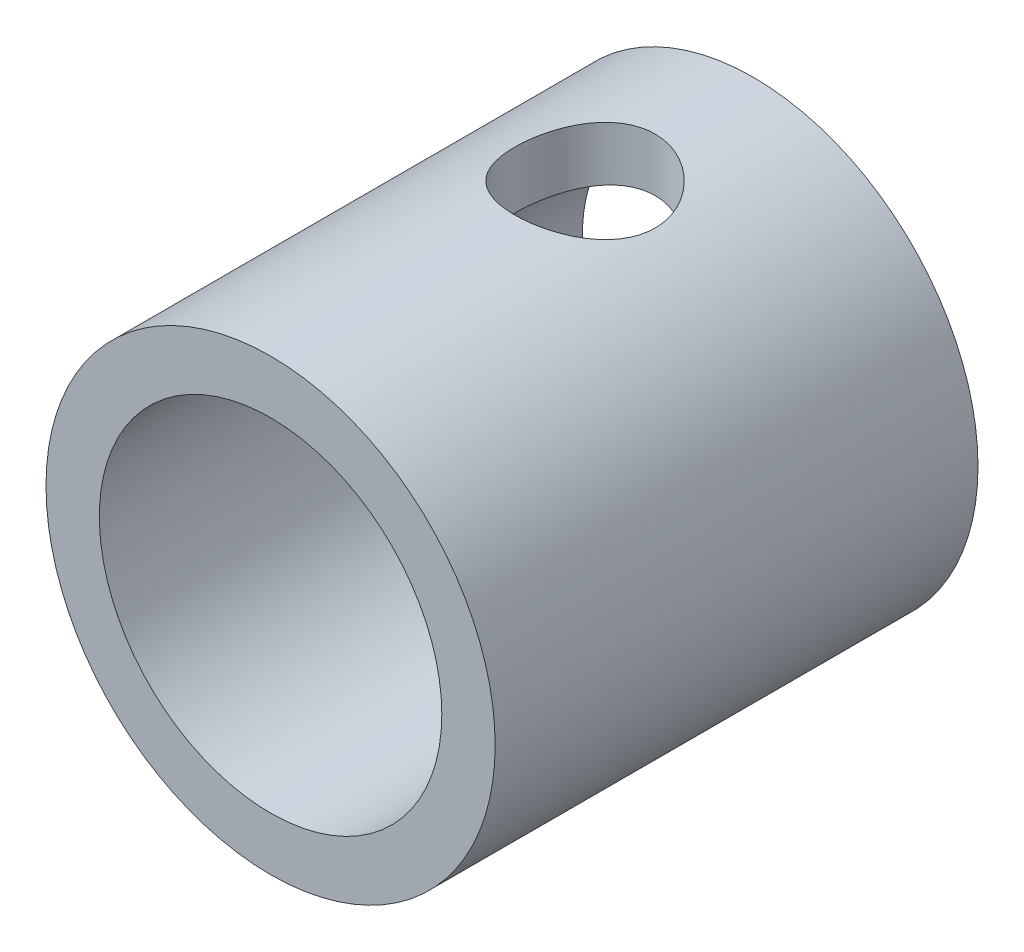
ISO-10303-21;
HEADER;
FILE_DESCRIPTION(('STEP AP214'),'2;1');
FILE_NAME('part.step','',(''),(''),'','','');
FILE_SCHEMA(('AUTOMOTIVE_DESIGN { 1 0 10303 214 1 1 1 1 }'));
ENDSEC;
DATA;
#1=APPLICATION_CONTEXT('core data for automotive mechanical design processes');
#2=APPLICATION_PROTOCOL_DEFINITION('international standard','automotive_design',2000,#1);
#3=PRODUCT_CONTEXT('',#1,'mechanical');
#4=PRODUCT('Part','Part','',(#3));
#5=PRODUCT_RELATED_PRODUCT_CATEGORY('part','',(#4));
#6=PRODUCT_DEFINITION_FORMATION('','',#4);
#7=PRODUCT_DEFINITION_CONTEXT('part definition',#1,'design');
#8=PRODUCT_DEFINITION('design','',#6,#7);
#9=PRODUCT_DEFINITION_SHAPE('','',#8);
#10=(LENGTH_UNIT() NAMED_UNIT(*) SI_UNIT(.MILLI.,.METRE.));
#11=(NAMED_UNIT(*) PLANE_ANGLE_UNIT() SI_UNIT($,.RADIAN.));
#12=(NAMED_UNIT(*) SI_UNIT($,.STERADIAN.) SOLID_ANGLE_UNIT());
#13=UNCERTAINTY_MEASURE_WITH_UNIT(LENGTH_MEASURE(1.E-05),#10,'distance_accuracy_value','');
#14=(GEOMETRIC_REPRESENTATION_CONTEXT(3) GLOBAL_UNCERTAINTY_ASSIGNED_CONTEXT((#13)) GLOBAL_UNIT_ASSIGNED_CONTEXT((#10,
#11,#12)) REPRESENTATION_CONTEXT('',''));
#15=CARTESIAN_POINT('',(0.,0.,0.));
#16=DIRECTION('',(0.,0.,1.));
#17=DIRECTION('',(1.,0.,0.));
#18=AXIS2_PLACEMENT_3D('',#15,#16,#17);
#19=CARTESIAN_POINT('',(0.,0.,-4.3));
#20=DIRECTION('',(0.,0.,1.));
#21=DIRECTION('',(1.,0.,0.));
#22=AXIS2_PLACEMENT_3D('',#19,#20,#21);
#23=CYLINDRICAL_SURFACE('',#22,4.);
#24=CARTESIAN_POINT('',(0.,0.,-4.3));
#25=DIRECTION('',(0.,0.,1.));
#26=DIRECTION('',(1.,0.,0.));
#27=AXIS2_PLACEMENT_3D('',#24,#25,#26);
#28=CIRCLE('',#27,4.);
#29=CARTESIAN_POINT('',(4.,0.,-4.3));
#30=VERTEX_POINT('',#29);
#31=EDGE_CURVE('E10',#30,#30,#28,.T.);
#32=ORIENTED_EDGE('',*,*,#31,.T.);
#33=EDGE_LOOP('',(#32));
#34=FACE_BOUND('',#33,.T.);
#35=CARTESIAN_POINT('',(0.,0.,4.3));
#36=DIRECTION('',(0.,0.,1.));
#37=DIRECTION('',(1.,0.,0.));
#38=AXIS2_PLACEMENT_3D('',#35,#36,#37);
#39=CIRCLE('',#38,4.);
#40=CARTESIAN_POINT('',(4.,0.,4.3));
#41=VERTEX_POINT('',#40);
#42=EDGE_CURVE('E43',#41,#41,#39,.T.);
#43=ORIENTED_EDGE('',*,*,#42,.F.);
#44=EDGE_LOOP('',(#43));
#45=FACE_BOUND('',#44,.T.);
#46=CARTESIAN_POINT('',(0.,4.,-2.55));
#47=CARTESIAN_POINT('',(0.0684391851745465,3.99999965877989,-2.54999955341243));
#48=CARTESIAN_POINT('',(0.136883052502859,3.99822694984841,-2.54436077305555));
#49=CARTESIAN_POINT('',(0.271769209588449,3.99132894088807,-2.52201375846077));
#50=CARTESIAN_POINT('',(0.338211042725908,3.9862028819986,-2.50530301863564));
#51=CARTESIAN_POINT('',(0.467128543650807,3.97315815697909,-2.46143062880426));
#52=CARTESIAN_POINT('',(0.529610176985804,3.96524381499025,-2.43428515534704));
#53=CARTESIAN_POINT('',(0.64913480234646,3.94743969161093,-2.37038268232167));
#54=CARTESIAN_POINT('',(0.706176935444885,3.93754959899905,-2.33362416821942));
#55=CARTESIAN_POINT('',(0.814965334952281,3.91650213740282,-2.25034400798264));
#56=CARTESIAN_POINT('',(0.86652002815666,3.90531715926989,-2.20357911493893));
#57=CARTESIAN_POINT('',(0.961197382036994,3.88310046374208,-2.10213160758645));
#58=CARTESIAN_POINT('',(1.0043184728987,3.87206877523457,-2.04744752250545));
#59=CARTESIAN_POINT('',(1.08194336483114,3.85111144698172,-1.93005543619192));
#60=CARTESIAN_POINT('',(1.11620784150129,3.84121988301796,-1.86718252247278));
#61=CARTESIAN_POINT('',(1.17359741076672,3.82407801799234,-1.73620768501813));
#62=CARTESIAN_POINT('',(1.19672543771945,3.81682702128689,-1.66810714420607));
#63=CARTESIAN_POINT('',(1.23048459930034,3.80607606984501,-1.53077192254794));
#64=CARTESIAN_POINT('',(1.24147110007865,3.80246972929508,-1.46163315636115));
#65=CARTESIAN_POINT('',(1.25174555036988,3.7991005514095,-1.32240688108811));
#66=CARTESIAN_POINT('',(1.25103660995772,3.79933669227334,-1.25231962917834));
#67=CARTESIAN_POINT('',(1.23821824732739,3.80353189075438,-1.11612553973102));
#68=CARTESIAN_POINT('',(1.22656057869383,3.80734341745948,-1.04997087413844));
#69=CARTESIAN_POINT('',(1.19290813355626,3.81802025652489,-0.920607843462654));
#70=CARTESIAN_POINT('',(1.17091225844551,3.82488589343115,-0.857399792291201));
#71=CARTESIAN_POINT('',(1.11688874681277,3.84101044014297,-0.734648055567365));
#72=CARTESIAN_POINT('',(1.08471925662082,3.85030284660824,-0.675171389308017));
#73=CARTESIAN_POINT('',(1.01136020737848,3.8702185658007,-0.562312232120876));
#74=CARTESIAN_POINT('',(0.970168305215774,3.88084222394551,-0.508931329746288));
#75=CARTESIAN_POINT('',(0.877716954182125,3.90281527800493,-0.407225056583012));
#76=CARTESIAN_POINT('',(0.826084570592818,3.91417569605696,-0.359240442220316));
#77=CARTESIAN_POINT('',(0.715364408095531,3.9359157075958,-0.272528106420321));
#78=CARTESIAN_POINT('',(0.656276077349021,3.94629522838372,-0.233801070780791));
#79=CARTESIAN_POINT('',(0.531664610465455,3.96501294890191,-0.166472311398725));
#80=CARTESIAN_POINT('',(0.46609490691928,3.97333460648208,-0.137951864536031));
#81=CARTESIAN_POINT('',(0.330767977782645,3.98687955828554,-0.0924469991484332));
#82=CARTESIAN_POINT('',(0.261012030724609,3.99210379325151,-0.0754590777616039));
#83=CARTESIAN_POINT('',(0.122185157290345,3.99871389395014,-0.0540819574210204));
#84=CARTESIAN_POINT('',(0.0531918487888426,4.00024022895439,-0.0492314564064768));
#85=CARTESIAN_POINT('',(-0.0846303057325847,3.99969799730981,-0.0509662266373284));
#86=CARTESIAN_POINT('',(-0.153459174306506,3.99762995581125,-0.0575498273226032));
#87=CARTESIAN_POINT('',(-0.287219332975852,3.99022363769772,-0.0815955926063945));
#88=CARTESIAN_POINT('',(-0.352204978420948,3.98496793110725,-0.0987832676125153));
#89=CARTESIAN_POINT('',(-0.478351928861365,3.97180121379252,-0.143214352366688));
#90=CARTESIAN_POINT('',(-0.539512760449016,3.96388987514204,-0.170459004024906));
#91=CARTESIAN_POINT('',(-0.657932406672232,3.94598542759568,-0.234973216548794));
#92=CARTESIAN_POINT('',(-0.715059739787955,3.9359462681821,-0.272470987497219));
#93=CARTESIAN_POINT('',(-0.822365850960096,3.91493410002887,-0.356153210117016));
#94=CARTESIAN_POINT('',(-0.872542738043336,3.90396083845862,-0.402340017743114));
#95=CARTESIAN_POINT('',(-0.966587462919657,3.88176994885247,-0.504258890053686));
#96=CARTESIAN_POINT('',(-1.01012652339774,3.87055986714446,-0.560296663745259));
#97=CARTESIAN_POINT('',(-1.08721250244909,3.84961947087602,-0.679126616370739));
#98=CARTESIAN_POINT('',(-1.12075957972524,3.839889132814,-0.741918688004432));
#99=CARTESIAN_POINT('',(-1.17670083481141,3.82311782360754,-0.872345172885859));
#100=CARTESIAN_POINT('',(-1.19913819558886,3.81606646468027,-0.939959649504699));
#101=CARTESIAN_POINT('',(-1.23222894320964,3.80551170941212,-1.0782724933238));
#102=CARTESIAN_POINT('',(-1.2428868141461,3.80200696302675,-1.14896967637131));
#103=CARTESIAN_POINT('',(-1.2517940615754,3.79908292712494,-1.28800408755424));
#104=CARTESIAN_POINT('',(-1.25058279621957,3.79948604683077,-1.35630345381293));
#105=CARTESIAN_POINT('',(-1.23708818129474,3.80390090472383,-1.49167458491918));
#106=CARTESIAN_POINT('',(-1.22480534822559,3.80791247457319,-1.558746406884));
#107=CARTESIAN_POINT('',(-1.18987729913378,3.81896814158112,-1.68879403960178));
#108=CARTESIAN_POINT('',(-1.16738642405944,3.82596698183474,-1.75181544109601));
#109=CARTESIAN_POINT('',(-1.11280227335064,3.84219704261348,-1.87324041353135));
#110=CARTESIAN_POINT('',(-1.08070704444254,3.85142871716522,-1.93164304207768));
#111=CARTESIAN_POINT('',(-1.00635675013475,3.8715348703158,-2.04464597044057));
#112=CARTESIAN_POINT('',(-0.963753335241275,3.88245948922441,-2.09900812950044));
#113=CARTESIAN_POINT('',(-0.870208996404849,3.90448998821726,-2.1999863281118));
#114=CARTESIAN_POINT('',(-0.819265842344403,3.91559591606795,-2.24660028899101));
#115=CARTESIAN_POINT('',(-0.708486662823333,3.93717271952329,-2.33228253836299));
#116=CARTESIAN_POINT('',(-0.648414574487381,3.94761101730634,-2.37105473644997));
#117=CARTESIAN_POINT('',(-0.522279138013654,3.96626769296916,-2.43789891513944));
#118=CARTESIAN_POINT('',(-0.45621815779545,3.97448694315832,-2.46597510214183));
#119=CARTESIAN_POINT('',(-0.325747635373978,3.98720650733461,-2.50859136760847));
#120=CARTESIAN_POINT('',(-0.261670337112546,3.99196240806139,-2.52407486730534));
#121=CARTESIAN_POINT('',(-0.131729895440248,3.99835900340486,-2.54477835996772));
#122=CARTESIAN_POINT('',(-0.0658671161396747,4.00000032839644,-2.550000429804));
#123=CARTESIAN_POINT('',(0.,4.,-2.55));
#124=B_SPLINE_CURVE_WITH_KNOTS('',3,(#46,#47,#48,#49,#50,#51,#52,#53,#54,#55,#56,#57,#58,#59,
#60,#61,#62,#63,#64,#65,#66,#67,#68,#69,#70,#71,#72,#73,#74,#75,#76,#77,#78,#79,#80,#81,#82,#83,
#84,#85,#86,#87,#88,#89,#90,#91,#92,#93,#94,#95,#96,#97,#98,#99,#100,#101,#102,#103,#104,#105,
#106,#107,#108,#109,#110,#111,#112,#113,#114,#115,#116,#117,#118,#119,#120,#121,#122,#123),
.UNSPECIFIED.,.T.,.F.,(4,2,2,2,2,2,2,2,2,2,2,2,2,2,2,2,2,2,2,2,2,2,2,2,2,2,2,2,2,2,2,2,2,2,2,2,
2,2,4),(0.,0.20507544943251,0.410197323349067,0.615002479202437,0.819839921558392,
1.03037822195158,1.24095567431276,1.45673771247494,1.67246286279527,1.8816915016721,
2.09086450295138,2.29176917422169,2.49269519979063,2.69655642720545,2.90047066010359,
3.113667472796,3.32688007413303,3.5417546068977,3.75656384494554,3.96307568548238,
4.16955735649363,4.37090626722872,4.572280050345,4.77856324738344,4.9849024570926,
5.1994177871314,5.41392970983713,5.62760115751032,5.84119123892431,6.04512203476054,
6.24904331751085,6.44997913396672,6.65095584330175,6.85979514006362,7.06869037373341,
7.28440668126413,7.50003806666338,7.69744636651542,7.89481470763049),.UNSPECIFIED.);
#125=CARTESIAN_POINT('',(0.,4.,-2.55));
#126=VERTEX_POINT('',#125);
#127=EDGE_CURVE('E53',#126,#126,#124,.T.);
#128=ORIENTED_EDGE('',*,*,#127,.T.);
#129=EDGE_LOOP('',(#128));
#130=FACE_BOUND('',#129,.T.);
#131=ADVANCED_FACE('F31',(#34,#45,#130),#23,.T.);
#132=CARTESIAN_POINT('',(0.,0.,-4.3));
#133=DIRECTION('',(0.,0.,1.));
#134=DIRECTION('',(1.,0.,0.));
#135=AXIS2_PLACEMENT_3D('',#132,#133,#134);
#136=CYLINDRICAL_SURFACE('',#135,3.05);
#137=CARTESIAN_POINT('',(0.,0.,4.3));
#138=DIRECTION('',(0.,0.,1.));
#139=DIRECTION('',(1.,0.,0.));
#140=AXIS2_PLACEMENT_3D('',#137,#138,#139);
#141=CIRCLE('',#140,3.05);
#142=CARTESIAN_POINT('',(3.05,0.,4.3));
#143=VERTEX_POINT('',#142);
#144=EDGE_CURVE('E50',#143,#143,#141,.T.);
#145=ORIENTED_EDGE('',*,*,#144,.T.);
#146=EDGE_LOOP('',(#145));
#147=FACE_BOUND('',#146,.T.);
#148=CARTESIAN_POINT('',(0.,0.,-4.3));
#149=DIRECTION('',(0.,0.,1.));
#150=DIRECTION('',(1.,0.,0.));
#151=AXIS2_PLACEMENT_3D('',#148,#149,#150);
#152=CIRCLE('',#151,3.05);
#153=CARTESIAN_POINT('',(3.05,0.,-4.3));
#154=VERTEX_POINT('',#153);
#155=EDGE_CURVE('E48',#154,#154,#152,.T.);
#156=ORIENTED_EDGE('',*,*,#155,.F.);
#157=EDGE_LOOP('',(#156));
#158=FACE_BOUND('',#157,.T.);
#159=CARTESIAN_POINT('',(0.,3.05,-2.55));
#160=CARTESIAN_POINT('',(0.0670510544943489,3.0499949013604,-2.54999317358085));
#161=CARTESIAN_POINT('',(0.134212209395161,3.04776316601173,-2.5445728904159));
#162=CARTESIAN_POINT('',(0.266635315129613,3.03905220749816,-2.52308214272691));
#163=CARTESIAN_POINT('',(0.331891740879612,3.0325617055695,-2.50698339650831));
#164=CARTESIAN_POINT('',(0.458374292847517,3.01603149034563,-2.46482596800736));
#165=CARTESIAN_POINT('',(0.519613092935801,3.00600364451594,-2.43880056530879));
#166=CARTESIAN_POINT('',(0.636797753940147,2.98337979201622,-2.37766372514543));
#167=CARTESIAN_POINT('',(0.692745306660152,2.97078461030852,-2.34255520538644));
#168=CARTESIAN_POINT('',(0.800582682290264,2.94360272183732,-2.26243359833868));
#169=CARTESIAN_POINT('',(0.852179618836315,2.92895218720805,-2.21704813784626));
#170=CARTESIAN_POINT('',(0.947279805792781,2.8995935820288,-2.11844769395315));
#171=CARTESIAN_POINT('',(0.990778921618127,2.88488548598071,-2.06522873562099));
#172=CARTESIAN_POINT('',(1.07047635819199,2.85630174305004,-1.94942208796871));
#173=CARTESIAN_POINT('',(1.10623272255294,2.84249824263372,-1.88651058665789));
#174=CARTESIAN_POINT('',(1.16652509902148,2.81829427065235,-1.75491722684178));
#175=CARTESIAN_POINT('',(1.1910667050528,2.80789210323985,-1.68623826542879));
#176=CARTESIAN_POINT('',(1.227033698322,2.79235707938261,-1.54842884283273));
#177=CARTESIAN_POINT('',(1.23902161527503,2.78699943260883,-1.47947149284317));
#178=CARTESIAN_POINT('',(1.25129693566521,2.78151145539133,-1.34033187566907));
#179=CARTESIAN_POINT('',(1.25159049579919,2.78137837438494,-1.27015027248522));
#180=CARTESIAN_POINT('',(1.24089353762405,2.78616368996563,-1.13607409840986));
#181=CARTESIAN_POINT('',(1.23073314256809,2.79071047916049,-1.07209740726591));
#182=CARTESIAN_POINT('',(1.20080567936669,2.80371701324257,-0.946852717037927));
#183=CARTESIAN_POINT('',(1.18103684064336,2.81217747930137,-0.885585219456467));
#184=CARTESIAN_POINT('',(1.13207159424285,2.83224715740188,-0.765978567347352));
#185=CARTESIAN_POINT('',(1.10268647565431,2.84391858333761,-0.707727575349722));
#186=CARTESIAN_POINT('',(1.03545581744839,2.8690795378448,-0.596761893197123));
#187=CARTESIAN_POINT('',(0.997607004659703,2.88256976900066,-0.544049356557174));
#188=CARTESIAN_POINT('',(0.910899790311779,2.91118669367845,-0.441135062715745));
#189=CARTESIAN_POINT('',(0.861395461770471,2.92635714795841,-0.391488171192123));
#190=CARTESIAN_POINT('',(0.754608431641012,2.95569448523891,-0.301018338182334));
#191=CARTESIAN_POINT('',(0.697324028210362,2.96986114763167,-0.260197332381149));
#192=CARTESIAN_POINT('',(0.574963428546576,2.9959821432301,-0.187760194769935));
#193=CARTESIAN_POINT('',(0.509745275727026,3.00788187819974,-0.156362719357233));
#194=CARTESIAN_POINT('',(0.374340888422931,3.02771185130719,-0.105178031129964));
#195=CARTESIAN_POINT('',(0.304157330168566,3.03564420943661,-0.0853846166402333));
#196=CARTESIAN_POINT('',(0.165457200410406,3.04625363825052,-0.0591149978575565));
#197=CARTESIAN_POINT('',(0.0971041510370848,3.04922426910946,-0.0518937278443175));
#198=CARTESIAN_POINT('',(-0.0398955862818339,3.0505074612745,-0.0487609214975451));
#199=CARTESIAN_POINT('',(-0.108542188170875,3.04882130524732,-0.0528462708661596));
#200=CARTESIAN_POINT('',(-0.240737900013712,3.04117156509262,-0.0716712173315416));
#201=CARTESIAN_POINT('',(-0.304374017081181,3.03541570476584,-0.0858936747894244));
#202=CARTESIAN_POINT('',(-0.42829183751655,3.02042451329165,-0.123876054716339));
#203=CARTESIAN_POINT('',(-0.48857311278812,3.01118873925112,-0.14763719121059));
#204=CARTESIAN_POINT('',(-0.606169889878375,2.98977295322551,-0.204799284042728));
#205=CARTESIAN_POINT('',(-0.663336176977042,2.97751077732146,-0.238475441951231));
#206=CARTESIAN_POINT('',(-0.771409581257715,2.95135965585715,-0.314208116393019));
#207=CARTESIAN_POINT('',(-0.822314111200647,2.93747004246777,-0.35626807827196));
#208=CARTESIAN_POINT('',(-0.92012008901335,2.9083776173988,-0.450984403999419));
#209=CARTESIAN_POINT('',(-0.966500457883186,2.89315046142814,-0.504172759440454));
#210=CARTESIAN_POINT('',(-1.04981547564094,2.86397295744692,-0.617831957610412));
#211=CARTESIAN_POINT('',(-1.08674823252482,2.85002286554325,-0.678304255480187));
#212=CARTESIAN_POINT('',(-1.15044727242197,2.82491824303052,-0.80591935720062));
#213=CARTESIAN_POINT('',(-1.17708303960167,2.8138001745101,-0.873135003557597));
#214=CARTESIAN_POINT('',(-1.21843997613925,2.79614362783962,-1.01169404128461));
#215=CARTESIAN_POINT('',(-1.2331705397777,2.78960153937764,-1.08303413036748));
#216=CARTESIAN_POINT('',(-1.24938002982017,2.78237686582237,-1.22205571719577));
#217=CARTESIAN_POINT('',(-1.25176935125866,2.78129189039513,-1.28961071540186));
#218=CARTESIAN_POINT('',(-1.245642582678,2.78404131006805,-1.42411541510116));
#219=CARTESIAN_POINT('',(-1.23712804062635,2.78787500688879,-1.4910652011546));
#220=CARTESIAN_POINT('',(-1.21019142460487,2.79966724973413,-1.6194595845332));
#221=CARTESIAN_POINT('',(-1.19221729367759,2.80743875303861,-1.68101694579431));
#222=CARTESIAN_POINT('',(-1.14730173944125,2.82609039777681,-1.80026093044538));
#223=CARTESIAN_POINT('',(-1.12035781367662,2.83697140660187,-1.85794646824451));
#224=CARTESIAN_POINT('',(-1.05643453179975,2.86141244323642,-1.97152052867125));
#225=CARTESIAN_POINT('',(-1.0189569500526,2.87509264152987,-2.027102315584));
#226=CARTESIAN_POINT('',(-0.935740453402654,2.90324259102355,-2.13147333634056));
#227=CARTESIAN_POINT('',(-0.889998826180313,2.91771260035406,-2.1802603307468));
#228=CARTESIAN_POINT('',(-0.787775119330136,2.94701985281455,-2.27314082024466));
#229=CARTESIAN_POINT('',(-0.730767593453203,2.961812751821,-2.31667265144534));
#230=CARTESIAN_POINT('',(-0.609702629948097,2.98908126299053,-2.39357367951556));
#231=CARTESIAN_POINT('',(-0.545641976686486,3.00155581115557,-2.42693821461591));
#232=CARTESIAN_POINT('',(-0.41336370129548,3.02258806460315,-2.48180811191666));
#233=CARTESIAN_POINT('',(-0.345238284795167,3.03121040731175,-2.50351052450806));
#234=CARTESIAN_POINT('',(-0.206003832466597,3.04383134859934,-2.53495872650018));
#235=CARTESIAN_POINT('',(-0.134904929290664,3.04784450441534,-2.54474216568277));
#236=CARTESIAN_POINT('',(-0.0423987566110856,3.04978053015449,-2.54946289651356));
#237=CARTESIAN_POINT('',(-0.021204884093835,3.05000161244387,-2.55000215885385));
#238=CARTESIAN_POINT('',(0.,3.05,-2.55));
#239=B_SPLINE_CURVE_WITH_KNOTS('',3,(#159,#160,#161,#162,#163,#164,#165,#166,#167,#168,#169,
#170,#171,#172,#173,#174,#175,#176,#177,#178,#179,#180,#181,#182,#183,#184,#185,#186,#187,#188,
#189,#190,#191,#192,#193,#194,#195,#196,#197,#198,#199,#200,#201,#202,#203,#204,#205,#206,#207,
#208,#209,#210,#211,#212,#213,#214,#215,#216,#217,#218,#219,#220,#221,#222,#223,#224,#225,#226,
#227,#228,#229,#230,#231,#232,#233,#234,#235,#236,#237,#238),.UNSPECIFIED.,.T.,.F.,(4,2,2,2,2,2,
2,2,2,2,2,2,2,2,2,2,2,2,2,2,2,2,2,2,2,2,2,2,2,2,2,2,2,2,2,2,2,2,2,4),(0.,0.201094311180328,
0.402723354574276,0.603682285542813,0.804576743863712,1.0144449209133,1.22441996030868,
1.4443140997696,1.66409843594336,1.87354721803842,2.0828857307339,2.27679448285736,
2.47073898070665,2.66874390795884,2.86682554265505,3.08105274490334,3.29532688370778,
3.51424468844057,3.73304538781656,3.9383713254535,4.14364071369574,4.33912550528584,
4.53463518488674,4.73618655641972,4.93782092740473,5.15341391236427,5.36905003881045,
5.58733616568889,5.80544987646516,6.00721727204665,6.20895602688517,6.40190297186304,
6.5949037916918,6.79928960640034,7.00374262427852,7.22240178249371,7.44116104698128,
7.65609749208753,7.87035321839587,7.93394925864707),.UNSPECIFIED.);
#240=CARTESIAN_POINT('',(0.,3.05,-2.55));
#241=VERTEX_POINT('',#240);
#242=EDGE_CURVE('E35',#241,#241,#239,.T.);
#243=ORIENTED_EDGE('',*,*,#242,.F.);
#244=EDGE_LOOP('',(#243));
#245=FACE_BOUND('',#244,.T.);
#246=ADVANCED_FACE('F64',(#147,#158,#245),#136,.F.);
#247=CARTESIAN_POINT('',(0.,0.,-4.3));
#248=DIRECTION('',(0.,0.,1.));
#249=DIRECTION('',(1.,0.,0.));
#250=AXIS2_PLACEMENT_3D('',#247,#248,#249);
#251=PLANE('',#250);
#252=ORIENTED_EDGE('',*,*,#155,.T.);
#253=EDGE_LOOP('',(#252));
#254=FACE_BOUND('',#253,.T.);
#255=ORIENTED_EDGE('',*,*,#31,.F.);
#256=EDGE_LOOP('',(#255));
#257=FACE_BOUND('',#256,.T.);
#258=ADVANCED_FACE('F69',(#254,#257),#251,.F.);
#259=CARTESIAN_POINT('',(0.,0.,4.3));
#260=DIRECTION('',(0.,0.,1.));
#261=DIRECTION('',(1.,0.,0.));
#262=AXIS2_PLACEMENT_3D('',#259,#260,#261);
#263=PLANE('',#262);
#264=ORIENTED_EDGE('',*,*,#144,.F.);
#265=EDGE_LOOP('',(#264));
#266=FACE_BOUND('',#265,.T.);
#267=ORIENTED_EDGE('',*,*,#42,.T.);
#268=EDGE_LOOP('',(#267));
#269=FACE_BOUND('',#268,.T.);
#270=ADVANCED_FACE('F62',(#266,#269),#263,.T.);
#271=CARTESIAN_POINT('',(0.,4.,-1.3));
#272=DIRECTION('',(0.,-1.,0.));
#273=DIRECTION('',(0.,0.,-1.));
#274=AXIS2_PLACEMENT_3D('',#271,#272,#273);
#275=CYLINDRICAL_SURFACE('',#274,1.25);
#276=ORIENTED_EDGE('',*,*,#127,.F.);
#277=EDGE_LOOP('',(#276));
#278=FACE_BOUND('',#277,.T.);
#279=ORIENTED_EDGE('',*,*,#242,.T.);
#280=EDGE_LOOP('',(#279));
#281=FACE_BOUND('',#280,.T.);
#282=ADVANCED_FACE('F59',(#278,#281),#275,.F.);
#283=CLOSED_SHELL('',(#131,#246,#258,#270,#282));
#284=MANIFOLD_SOLID_BREP('B2',#283);
#285=ADVANCED_BREP_SHAPE_REPRESENTATION('',(#18,#284),#14);
#286=SHAPE_DEFINITION_REPRESENTATION(#9,#285);
ENDSEC;
END-ISO-10303-21;
